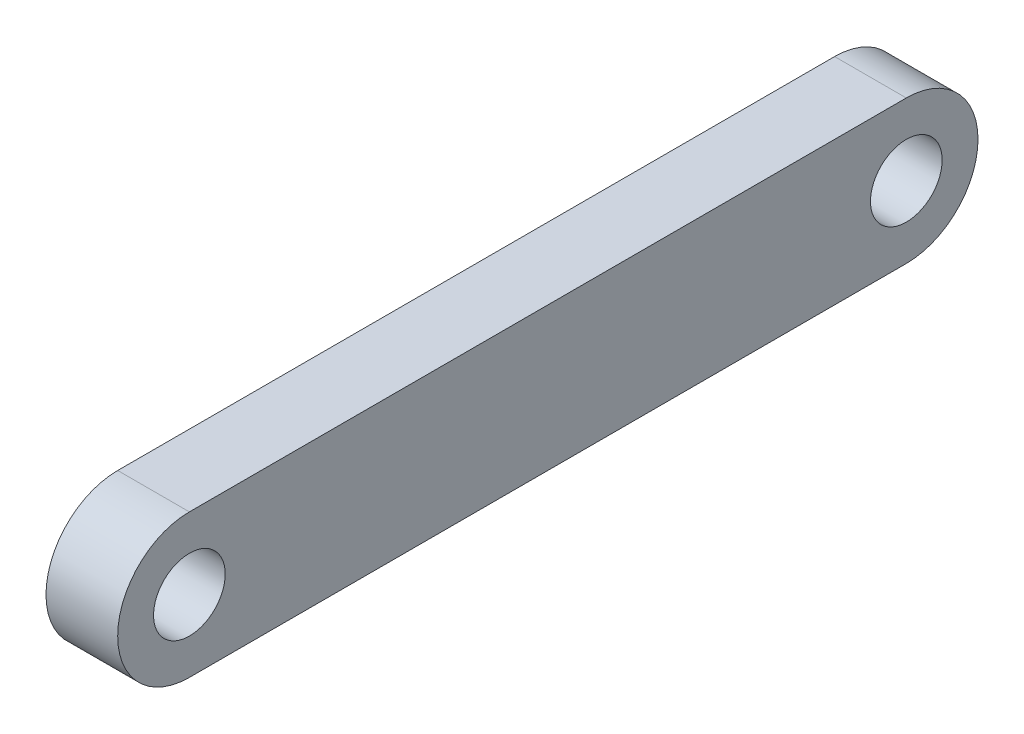
ISO-10303-21;
HEADER;
FILE_DESCRIPTION(('STEP AP214'),'2;1');
FILE_NAME('part.step','',(''),(''),'','','');
FILE_SCHEMA(('AUTOMOTIVE_DESIGN { 1 0 10303 214 1 1 1 1 }'));
ENDSEC;
DATA;
#1=APPLICATION_CONTEXT('core data for automotive mechanical design processes');
#2=APPLICATION_PROTOCOL_DEFINITION('international standard','automotive_design',2000,#1);
#3=PRODUCT_CONTEXT('',#1,'mechanical');
#4=PRODUCT('Part','Part','',(#3));
#5=PRODUCT_RELATED_PRODUCT_CATEGORY('part','',(#4));
#6=PRODUCT_DEFINITION_FORMATION('','',#4);
#7=PRODUCT_DEFINITION_CONTEXT('part definition',#1,'design');
#8=PRODUCT_DEFINITION('design','',#6,#7);
#9=PRODUCT_DEFINITION_SHAPE('','',#8);
#10=(LENGTH_UNIT() NAMED_UNIT(*) SI_UNIT(.MILLI.,.METRE.));
#11=(NAMED_UNIT(*) PLANE_ANGLE_UNIT() SI_UNIT($,.RADIAN.));
#12=(NAMED_UNIT(*) SI_UNIT($,.STERADIAN.) SOLID_ANGLE_UNIT());
#13=UNCERTAINTY_MEASURE_WITH_UNIT(LENGTH_MEASURE(1.E-05),#10,'distance_accuracy_value','');
#14=(GEOMETRIC_REPRESENTATION_CONTEXT(3) GLOBAL_UNCERTAINTY_ASSIGNED_CONTEXT((#13)) GLOBAL_UNIT_ASSIGNED_CONTEXT((#10,
#11,#12)) REPRESENTATION_CONTEXT('',''));
#15=CARTESIAN_POINT('',(0.,0.,0.));
#16=DIRECTION('',(0.,0.,1.));
#17=DIRECTION('',(1.,0.,0.));
#18=AXIS2_PLACEMENT_3D('',#15,#16,#17);
#19=CARTESIAN_POINT('',(8.,-7.99999999999999,0.));
#20=DIRECTION('',(0.,1.,0.));
#21=DIRECTION('',(0.,0.,1.));
#22=AXIS2_PLACEMENT_3D('',#19,#20,#21);
#23=PLANE('',#22);
#24=DIRECTION('',(0.,0.,-1.));
#25=VECTOR('',#24,1.);
#26=CARTESIAN_POINT('',(0.,-7.99999999999999,0.));
#27=LINE('',#26,#25);
#28=CARTESIAN_POINT('',(0.,-7.99999999999999,40.));
#29=VERTEX_POINT('',#28);
#30=CARTESIAN_POINT('',(0.,-7.99999999999999,-40.));
#31=VERTEX_POINT('',#30);
#32=EDGE_CURVE('E107',#29,#31,#27,.T.);
#33=ORIENTED_EDGE('',*,*,#32,.T.);
#34=DIRECTION('',(-1.,0.,0.));
#35=VECTOR('',#34,1.);
#36=CARTESIAN_POINT('',(8.,-7.99999999999999,-40.));
#37=LINE('',#36,#35);
#38=CARTESIAN_POINT('',(8.,-7.99999999999999,-40.));
#39=VERTEX_POINT('',#38);
#40=EDGE_CURVE('E11',#39,#31,#37,.T.);
#41=ORIENTED_EDGE('',*,*,#40,.F.);
#42=DIRECTION('',(0.,0.,-1.));
#43=VECTOR('',#42,1.);
#44=CARTESIAN_POINT('',(8.,-7.99999999999999,0.));
#45=LINE('',#44,#43);
#46=CARTESIAN_POINT('',(8.,-7.99999999999999,40.));
#47=VERTEX_POINT('',#46);
#48=EDGE_CURVE('E87',#47,#39,#45,.T.);
#49=ORIENTED_EDGE('',*,*,#48,.F.);
#50=DIRECTION('',(-1.,0.,0.));
#51=VECTOR('',#50,1.);
#52=CARTESIAN_POINT('',(8.,-7.99999999999999,40.));
#53=LINE('',#52,#51);
#54=EDGE_CURVE('E54',#47,#29,#53,.T.);
#55=ORIENTED_EDGE('',*,*,#54,.T.);
#56=EDGE_LOOP('',(#33,#41,#49,#55));
#57=FACE_BOUND('',#56,.T.);
#58=ADVANCED_FACE('F37',(#57),#23,.F.);
#59=CARTESIAN_POINT('',(8.,0.,-40.));
#60=DIRECTION('',(-1.,0.,0.));
#61=DIRECTION('',(0.,0.,1.));
#62=AXIS2_PLACEMENT_3D('',#59,#60,#61);
#63=CYLINDRICAL_SURFACE('',#62,7.99999999999999);
#64=CARTESIAN_POINT('',(0.,0.,-40.));
#65=DIRECTION('',(1.,0.,0.));
#66=DIRECTION('',(0.,0.,-1.));
#67=AXIS2_PLACEMENT_3D('',#64,#65,#66);
#68=CIRCLE('',#67,7.99999999999999);
#69=CARTESIAN_POINT('',(0.,7.99999999999998,-40.));
#70=VERTEX_POINT('',#69);
#71=EDGE_CURVE('E92',#31,#70,#68,.T.);
#72=ORIENTED_EDGE('',*,*,#71,.T.);
#73=DIRECTION('',(-1.,0.,0.));
#74=VECTOR('',#73,1.);
#75=CARTESIAN_POINT('',(8.,7.99999999999998,-40.));
#76=LINE('',#75,#74);
#77=CARTESIAN_POINT('',(8.,7.99999999999998,-40.));
#78=VERTEX_POINT('',#77);
#79=EDGE_CURVE('E46',#78,#70,#76,.T.);
#80=ORIENTED_EDGE('',*,*,#79,.F.);
#81=CARTESIAN_POINT('',(8.,0.,-40.));
#82=DIRECTION('',(1.,0.,0.));
#83=DIRECTION('',(0.,0.,-1.));
#84=AXIS2_PLACEMENT_3D('',#81,#82,#83);
#85=CIRCLE('',#84,7.99999999999999);
#86=EDGE_CURVE('E79',#39,#78,#85,.T.);
#87=ORIENTED_EDGE('',*,*,#86,.F.);
#88=ORIENTED_EDGE('',*,*,#40,.T.);
#89=EDGE_LOOP('',(#72,#80,#87,#88));
#90=FACE_BOUND('',#89,.T.);
#91=ADVANCED_FACE('F91',(#90),#63,.T.);
#92=CARTESIAN_POINT('',(8.,7.99999999999998,0.));
#93=DIRECTION('',(0.,1.,0.));
#94=DIRECTION('',(0.,0.,1.));
#95=AXIS2_PLACEMENT_3D('',#92,#93,#94);
#96=PLANE('',#95);
#97=DIRECTION('',(0.,0.,-1.));
#98=VECTOR('',#97,1.);
#99=CARTESIAN_POINT('',(0.,7.99999999999998,0.));
#100=LINE('',#99,#98);
#101=CARTESIAN_POINT('',(0.,7.99999999999998,40.));
#102=VERTEX_POINT('',#101);
#103=EDGE_CURVE('E110',#102,#70,#100,.T.);
#104=ORIENTED_EDGE('',*,*,#103,.F.);
#105=DIRECTION('',(-1.,0.,0.));
#106=VECTOR('',#105,1.);
#107=CARTESIAN_POINT('',(8.,7.99999999999998,40.));
#108=LINE('',#107,#106);
#109=CARTESIAN_POINT('',(8.,7.99999999999998,40.));
#110=VERTEX_POINT('',#109);
#111=EDGE_CURVE('E68',#110,#102,#108,.T.);
#112=ORIENTED_EDGE('',*,*,#111,.F.);
#113=DIRECTION('',(0.,0.,-1.));
#114=VECTOR('',#113,1.);
#115=CARTESIAN_POINT('',(8.,7.99999999999998,0.));
#116=LINE('',#115,#114);
#117=EDGE_CURVE('E86',#110,#78,#116,.T.);
#118=ORIENTED_EDGE('',*,*,#117,.T.);
#119=ORIENTED_EDGE('',*,*,#79,.T.);
#120=EDGE_LOOP('',(#104,#112,#118,#119));
#121=FACE_BOUND('',#120,.T.);
#122=ADVANCED_FACE('F95',(#121),#96,.T.);
#123=CARTESIAN_POINT('',(8.,0.,40.));
#124=DIRECTION('',(-1.,0.,0.));
#125=DIRECTION('',(0.,0.,1.));
#126=AXIS2_PLACEMENT_3D('',#123,#124,#125);
#127=CYLINDRICAL_SURFACE('',#126,4.00000000000001);
#128=CARTESIAN_POINT('',(8.,0.,40.));
#129=DIRECTION('',(1.,0.,0.));
#130=DIRECTION('',(0.,0.,-1.));
#131=AXIS2_PLACEMENT_3D('',#128,#129,#130);
#132=CIRCLE('',#131,4.00000000000001);
#133=CARTESIAN_POINT('',(8.,0.,36.));
#134=VERTEX_POINT('',#133);
#135=EDGE_CURVE('E119',#134,#134,#132,.T.);
#136=ORIENTED_EDGE('',*,*,#135,.T.);
#137=EDGE_LOOP('',(#136));
#138=FACE_BOUND('',#137,.T.);
#139=CARTESIAN_POINT('',(0.,0.,40.));
#140=DIRECTION('',(1.,0.,0.));
#141=DIRECTION('',(0.,0.,-1.));
#142=AXIS2_PLACEMENT_3D('',#139,#140,#141);
#143=CIRCLE('',#142,4.00000000000001);
#144=CARTESIAN_POINT('',(0.,0.,36.));
#145=VERTEX_POINT('',#144);
#146=EDGE_CURVE('E104',#145,#145,#143,.T.);
#147=ORIENTED_EDGE('',*,*,#146,.F.);
#148=EDGE_LOOP('',(#147));
#149=FACE_BOUND('',#148,.T.);
#150=ADVANCED_FACE('F127',(#138,#149),#127,.F.);
#151=CARTESIAN_POINT('',(8.,0.,-40.));
#152=DIRECTION('',(-1.,0.,0.));
#153=DIRECTION('',(0.,0.,1.));
#154=AXIS2_PLACEMENT_3D('',#151,#152,#153);
#155=CYLINDRICAL_SURFACE('',#154,4.00000000000001);
#156=CARTESIAN_POINT('',(8.,0.,-40.));
#157=DIRECTION('',(1.,0.,0.));
#158=DIRECTION('',(0.,0.,-1.));
#159=AXIS2_PLACEMENT_3D('',#156,#157,#158);
#160=CIRCLE('',#159,4.00000000000001);
#161=CARTESIAN_POINT('',(8.,0.,-44.));
#162=VERTEX_POINT('',#161);
#163=EDGE_CURVE('E115',#162,#162,#160,.F.);
#164=ORIENTED_EDGE('',*,*,#163,.F.);
#165=EDGE_LOOP('',(#164));
#166=FACE_BOUND('',#165,.T.);
#167=CARTESIAN_POINT('',(0.,0.,-40.));
#168=DIRECTION('',(1.,0.,0.));
#169=DIRECTION('',(0.,0.,-1.));
#170=AXIS2_PLACEMENT_3D('',#167,#168,#169);
#171=CIRCLE('',#170,4.00000000000001);
#172=CARTESIAN_POINT('',(0.,0.,-44.));
#173=VERTEX_POINT('',#172);
#174=EDGE_CURVE('E101',#173,#173,#171,.F.);
#175=ORIENTED_EDGE('',*,*,#174,.T.);
#176=EDGE_LOOP('',(#175));
#177=FACE_BOUND('',#176,.T.);
#178=ADVANCED_FACE('F39',(#166,#177),#155,.F.);
#179=CARTESIAN_POINT('',(8.,0.,40.));
#180=DIRECTION('',(-1.,0.,0.));
#181=DIRECTION('',(0.,0.,1.));
#182=AXIS2_PLACEMENT_3D('',#179,#180,#181);
#183=CYLINDRICAL_SURFACE('',#182,7.99999999999999);
#184=CARTESIAN_POINT('',(0.,0.,40.));
#185=DIRECTION('',(1.,0.,0.));
#186=DIRECTION('',(0.,0.,-1.));
#187=AXIS2_PLACEMENT_3D('',#184,#185,#186);
#188=CIRCLE('',#187,7.99999999999999);
#189=EDGE_CURVE('E112',#29,#102,#188,.F.);
#190=ORIENTED_EDGE('',*,*,#189,.F.);
#191=ORIENTED_EDGE('',*,*,#54,.F.);
#192=CARTESIAN_POINT('',(8.,0.,40.));
#193=DIRECTION('',(1.,0.,0.));
#194=DIRECTION('',(0.,0.,-1.));
#195=AXIS2_PLACEMENT_3D('',#192,#193,#194);
#196=CIRCLE('',#195,7.99999999999999);
#197=EDGE_CURVE('E96',#47,#110,#196,.F.);
#198=ORIENTED_EDGE('',*,*,#197,.T.);
#199=ORIENTED_EDGE('',*,*,#111,.T.);
#200=EDGE_LOOP('',(#190,#191,#198,#199));
#201=FACE_BOUND('',#200,.T.);
#202=ADVANCED_FACE('F132',(#201),#183,.T.);
#203=CARTESIAN_POINT('',(8.,0.,0.));
#204=DIRECTION('',(1.,0.,0.));
#205=DIRECTION('',(0.,0.,-1.));
#206=AXIS2_PLACEMENT_3D('',#203,#204,#205);
#207=PLANE('',#206);
#208=ORIENTED_EDGE('',*,*,#163,.T.);
#209=EDGE_LOOP('',(#208));
#210=FACE_BOUND('',#209,.T.);
#211=ORIENTED_EDGE('',*,*,#135,.F.);
#212=EDGE_LOOP('',(#211));
#213=FACE_BOUND('',#212,.T.);
#214=ORIENTED_EDGE('',*,*,#48,.T.);
#215=ORIENTED_EDGE('',*,*,#86,.T.);
#216=ORIENTED_EDGE('',*,*,#117,.F.);
#217=ORIENTED_EDGE('',*,*,#197,.F.);
#218=EDGE_LOOP('',(#214,#215,#216,#217));
#219=FACE_BOUND('',#218,.T.);
#220=ADVANCED_FACE('F83',(#210,#213,#219),#207,.T.);
#221=CARTESIAN_POINT('',(0.,0.,0.));
#222=DIRECTION('',(1.,0.,0.));
#223=DIRECTION('',(0.,0.,-1.));
#224=AXIS2_PLACEMENT_3D('',#221,#222,#223);
#225=PLANE('',#224);
#226=ORIENTED_EDGE('',*,*,#174,.F.);
#227=EDGE_LOOP('',(#226));
#228=FACE_BOUND('',#227,.T.);
#229=ORIENTED_EDGE('',*,*,#146,.T.);
#230=EDGE_LOOP('',(#229));
#231=FACE_BOUND('',#230,.T.);
#232=ORIENTED_EDGE('',*,*,#32,.F.);
#233=ORIENTED_EDGE('',*,*,#189,.T.);
#234=ORIENTED_EDGE('',*,*,#103,.T.);
#235=ORIENTED_EDGE('',*,*,#71,.F.);
#236=EDGE_LOOP('',(#232,#233,#234,#235));
#237=FACE_BOUND('',#236,.T.);
#238=ADVANCED_FACE('F131',(#228,#231,#237),#225,.F.);
#239=CLOSED_SHELL('',(#58,#91,#122,#150,#178,#202,#220,#238));
#240=MANIFOLD_SOLID_BREP('B2',#239);
#241=ADVANCED_BREP_SHAPE_REPRESENTATION('',(#18,#240),#14);
#242=SHAPE_DEFINITION_REPRESENTATION(#9,#241);
ENDSEC;
END-ISO-10303-21;
